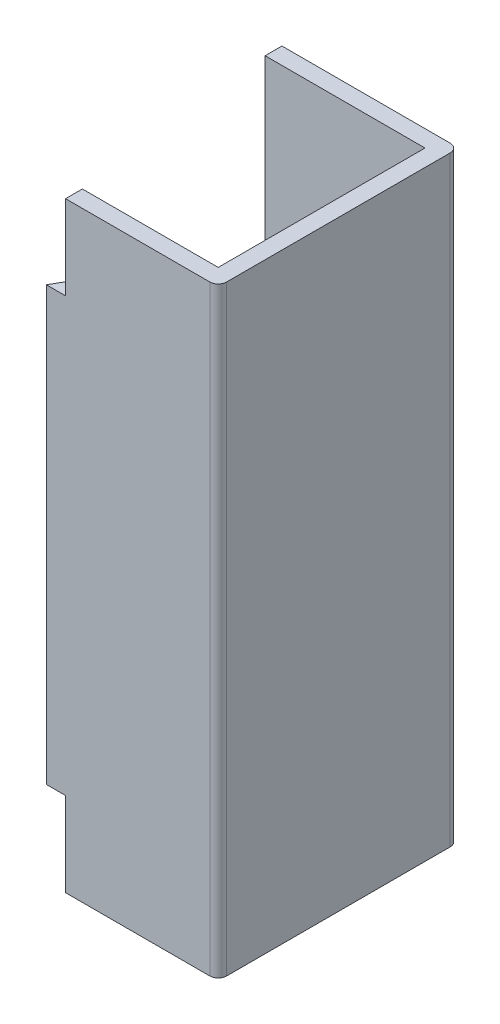
ISO-10303-21;
HEADER;
FILE_DESCRIPTION(('STEP AP214'),'2;1');
FILE_NAME('part.step','',(''),(''),'','','');
FILE_SCHEMA(('AUTOMOTIVE_DESIGN { 1 0 10303 214 1 1 1 1 }'));
ENDSEC;
DATA;
#1=APPLICATION_CONTEXT('core data for automotive mechanical design processes');
#2=APPLICATION_PROTOCOL_DEFINITION('international standard','automotive_design',2000,#1);
#3=PRODUCT_CONTEXT('',#1,'mechanical');
#4=PRODUCT('Part','Part','',(#3));
#5=PRODUCT_RELATED_PRODUCT_CATEGORY('part','',(#4));
#6=PRODUCT_DEFINITION_FORMATION('','',#4);
#7=PRODUCT_DEFINITION_CONTEXT('part definition',#1,'design');
#8=PRODUCT_DEFINITION('design','',#6,#7);
#9=PRODUCT_DEFINITION_SHAPE('','',#8);
#10=(LENGTH_UNIT() NAMED_UNIT(*) SI_UNIT(.MILLI.,.METRE.));
#11=(NAMED_UNIT(*) PLANE_ANGLE_UNIT() SI_UNIT($,.RADIAN.));
#12=(NAMED_UNIT(*) SI_UNIT($,.STERADIAN.) SOLID_ANGLE_UNIT());
#13=UNCERTAINTY_MEASURE_WITH_UNIT(LENGTH_MEASURE(1.E-05),#10,'distance_accuracy_value','');
#14=(GEOMETRIC_REPRESENTATION_CONTEXT(3) GLOBAL_UNCERTAINTY_ASSIGNED_CONTEXT((#13)) GLOBAL_UNIT_ASSIGNED_CONTEXT((#10,
#11,#12)) REPRESENTATION_CONTEXT('',''));
#15=CARTESIAN_POINT('',(0.,0.,0.));
#16=DIRECTION('',(0.,0.,1.));
#17=DIRECTION('',(1.,0.,0.));
#18=AXIS2_PLACEMENT_3D('',#15,#16,#17);
#19=CARTESIAN_POINT('',(0.6825,0.45,0.465));
#20=DIRECTION('',(0.,1.,0.));
#21=DIRECTION('',(0.,0.,1.));
#22=AXIS2_PLACEMENT_3D('',#19,#20,#21);
#23=PLANE('',#22);
#24=DIRECTION('',(0.50000000000019,0.,-0.866025403784329));
#25=VECTOR('',#24,1.);
#26=CARTESIAN_POINT('',(0.662707259422,0.45,0.465));
#27=LINE('',#26,#25);
#28=CARTESIAN_POINT('',(0.662707259422,0.45,0.465));
#29=VERTEX_POINT('',#28);
#30=CARTESIAN_POINT('',(0.642500000000088,0.45,0.500000000000051));
#31=VERTEX_POINT('',#30);
#32=EDGE_CURVE('E124',#29,#31,#27,.F.);
#33=ORIENTED_EDGE('',*,*,#32,.T.);
#34=DIRECTION('',(1.,0.,0.));
#35=VECTOR('',#34,1.);
#36=CARTESIAN_POINT('',(0.816902515723,0.45,0.5));
#37=LINE('',#36,#35);
#38=CARTESIAN_POINT('',(0.6825,0.45,0.5));
#39=VERTEX_POINT('',#38);
#40=EDGE_CURVE('E232',#39,#31,#37,.F.);
#41=ORIENTED_EDGE('',*,*,#40,.F.);
#42=DIRECTION('',(0.,0.,1.));
#43=VECTOR('',#42,1.);
#44=CARTESIAN_POINT('',(0.6825,0.45,0.4825));
#45=LINE('',#44,#43);
#46=CARTESIAN_POINT('',(0.6825,0.45,0.465));
#47=VERTEX_POINT('',#46);
#48=EDGE_CURVE('E144',#39,#47,#45,.F.);
#49=ORIENTED_EDGE('',*,*,#48,.T.);
#50=DIRECTION('',(-1.,0.,0.));
#51=VECTOR('',#50,1.);
#52=CARTESIAN_POINT('',(0.808201510334,0.45,0.465));
#53=LINE('',#52,#51);
#54=EDGE_CURVE('E138',#29,#47,#53,.F.);
#55=ORIENTED_EDGE('',*,*,#54,.F.);
#56=EDGE_LOOP('',(#33,#41,#49,#55));
#57=FACE_BOUND('',#56,.T.);
#58=ADVANCED_FACE('F17',(#57),#23,.T.);
#59=CARTESIAN_POINT('',(0.662707259422,-0.45,0.465));
#60=DIRECTION('',(0.866025403784329,0.,0.50000000000019));
#61=DIRECTION('',(0.50000000000019,0.,-0.866025403784329));
#62=AXIS2_PLACEMENT_3D('',#59,#60,#61);
#63=PLANE('',#62);
#64=DIRECTION('',(0.,1.,0.));
#65=VECTOR('',#64,1.);
#66=CARTESIAN_POINT('',(0.6425,0.,0.5));
#67=LINE('',#66,#65);
#68=CARTESIAN_POINT('',(0.6425,-0.45,0.5));
#69=VERTEX_POINT('',#68);
#70=EDGE_CURVE('E129',#31,#69,#67,.F.);
#71=ORIENTED_EDGE('',*,*,#70,.F.);
#72=ORIENTED_EDGE('',*,*,#32,.F.);
#73=DIRECTION('',(0.,1.,0.));
#74=VECTOR('',#73,1.);
#75=CARTESIAN_POINT('',(0.662707259422,0.,0.465));
#76=LINE('',#75,#74);
#77=CARTESIAN_POINT('',(0.662707259422,-0.45,0.465));
#78=VERTEX_POINT('',#77);
#79=EDGE_CURVE('E128',#78,#29,#76,.T.);
#80=ORIENTED_EDGE('',*,*,#79,.F.);
#81=DIRECTION('',(0.500000000006741,0.,-0.866025403780547));
#82=VECTOR('',#81,1.);
#83=CARTESIAN_POINT('',(0.6425,-0.45,0.5));
#84=LINE('',#83,#82);
#85=EDGE_CURVE('E133',#69,#78,#84,.T.);
#86=ORIENTED_EDGE('',*,*,#85,.F.);
#87=EDGE_LOOP('',(#71,#72,#80,#86));
#88=FACE_BOUND('',#87,.T.);
#89=ADVANCED_FACE('F126',(#88),#63,.F.);
#90=CARTESIAN_POINT('',(0.6825,-0.45,0.5));
#91=DIRECTION('',(0.,-1.,0.));
#92=DIRECTION('',(0.,0.,-1.));
#93=AXIS2_PLACEMENT_3D('',#90,#91,#92);
#94=PLANE('',#93);
#95=ORIENTED_EDGE('',*,*,#85,.T.);
#96=DIRECTION('',(-1.,0.,0.));
#97=VECTOR('',#96,1.);
#98=CARTESIAN_POINT('',(0.808201510334,-0.45,0.465));
#99=LINE('',#98,#97);
#100=CARTESIAN_POINT('',(0.6825,-0.45,0.465));
#101=VERTEX_POINT('',#100);
#102=EDGE_CURVE('E142',#101,#78,#99,.T.);
#103=ORIENTED_EDGE('',*,*,#102,.F.);
#104=DIRECTION('',(0.,0.,1.));
#105=VECTOR('',#104,1.);
#106=CARTESIAN_POINT('',(0.6825,-0.45,0.4825));
#107=LINE('',#106,#105);
#108=CARTESIAN_POINT('',(0.6825,-0.45,0.5));
#109=VERTEX_POINT('',#108);
#110=EDGE_CURVE('E163',#101,#109,#107,.T.);
#111=ORIENTED_EDGE('',*,*,#110,.T.);
#112=DIRECTION('',(1.,0.,0.));
#113=VECTOR('',#112,1.);
#114=CARTESIAN_POINT('',(0.816902515723,-0.45,0.5));
#115=LINE('',#114,#113);
#116=EDGE_CURVE('E209',#69,#109,#115,.T.);
#117=ORIENTED_EDGE('',*,*,#116,.F.);
#118=EDGE_LOOP('',(#95,#103,#111,#117));
#119=FACE_BOUND('',#118,.T.);
#120=ADVANCED_FACE('F330',(#119),#94,.T.);
#121=CARTESIAN_POINT('',(0.6825,0.,0.4825));
#122=DIRECTION('',(1.,0.,0.));
#123=DIRECTION('',(0.,1.,0.));
#124=AXIS2_PLACEMENT_3D('',#121,#122,#123);
#125=PLANE('',#124);
#126=DIRECTION('',(0.,0.,1.));
#127=VECTOR('',#126,1.);
#128=CARTESIAN_POINT('',(0.6825,0.625,0.239822058945));
#129=LINE('',#128,#127);
#130=CARTESIAN_POINT('',(0.6825,0.625,0.465));
#131=VERTEX_POINT('',#130);
#132=CARTESIAN_POINT('',(0.6825,0.625,0.5));
#133=VERTEX_POINT('',#132);
#134=EDGE_CURVE('E201',#131,#133,#129,.T.);
#135=ORIENTED_EDGE('',*,*,#134,.F.);
#136=DIRECTION('',(0.,1.,0.));
#137=VECTOR('',#136,1.);
#138=CARTESIAN_POINT('',(0.6825,0.,0.465));
#139=LINE('',#138,#137);
#140=EDGE_CURVE('E146',#47,#131,#139,.T.);
#141=ORIENTED_EDGE('',*,*,#140,.F.);
#142=ORIENTED_EDGE('',*,*,#48,.F.);
#143=DIRECTION('',(0.,1.,0.));
#144=VECTOR('',#143,1.);
#145=CARTESIAN_POINT('',(0.6825,0.,0.5));
#146=LINE('',#145,#144);
#147=EDGE_CURVE('E223',#133,#39,#146,.F.);
#148=ORIENTED_EDGE('',*,*,#147,.F.);
#149=EDGE_LOOP('',(#135,#141,#142,#148));
#150=FACE_BOUND('',#149,.T.);
#151=ADVANCED_FACE('F332',(#150),#125,.F.);
#152=CARTESIAN_POINT('',(0.6325,0.625,0.));
#153=DIRECTION('',(0.,0.,1.));
#154=DIRECTION('',(1.,0.,0.));
#155=AXIS2_PLACEMENT_3D('',#152,#153,#154);
#156=PLANE('',#155);
#157=DIRECTION('',(1.,0.,0.));
#158=VECTOR('',#157,1.);
#159=CARTESIAN_POINT('',(0.880177932085,-0.625,0.));
#160=LINE('',#159,#158);
#161=CARTESIAN_POINT('',(0.6325,-0.625,0.));
#162=VERTEX_POINT('',#161);
#163=CARTESIAN_POINT('',(0.9825,-0.625,0.));
#164=VERTEX_POINT('',#163);
#165=EDGE_CURVE('E174',#162,#164,#160,.T.);
#166=ORIENTED_EDGE('',*,*,#165,.F.);
#167=DIRECTION('',(0.,1.,0.));
#168=VECTOR('',#167,1.);
#169=CARTESIAN_POINT('',(0.6325,0.,0.));
#170=LINE('',#169,#168);
#171=CARTESIAN_POINT('',(0.6325,0.625,0.));
#172=VERTEX_POINT('',#171);
#173=EDGE_CURVE('E221',#172,#162,#170,.F.);
#174=ORIENTED_EDGE('',*,*,#173,.F.);
#175=DIRECTION('',(-1.,0.,0.));
#176=VECTOR('',#175,1.);
#177=CARTESIAN_POINT('',(0.880177932085,0.625,0.));
#178=LINE('',#177,#176);
#179=CARTESIAN_POINT('',(0.9825,0.625,0.));
#180=VERTEX_POINT('',#179);
#181=EDGE_CURVE('E70',#180,#172,#178,.T.);
#182=ORIENTED_EDGE('',*,*,#181,.F.);
#183=DIRECTION('',(0.,-1.,0.));
#184=VECTOR('',#183,1.);
#185=CARTESIAN_POINT('',(0.9825,0.625,0.));
#186=LINE('',#185,#184);
#187=EDGE_CURVE('E60',#164,#180,#186,.F.);
#188=ORIENTED_EDGE('',*,*,#187,.F.);
#189=EDGE_LOOP('',(#166,#174,#182,#188));
#190=FACE_BOUND('',#189,.T.);
#191=ADVANCED_FACE('F310',(#190),#156,.F.);
#192=CARTESIAN_POINT('',(0.6825,0.,0.4825));
#193=DIRECTION('',(1.,0.,0.));
#194=DIRECTION('',(0.,1.,0.));
#195=AXIS2_PLACEMENT_3D('',#192,#193,#194);
#196=PLANE('',#195);
#197=ORIENTED_EDGE('',*,*,#110,.F.);
#198=DIRECTION('',(0.,1.,0.));
#199=VECTOR('',#198,1.);
#200=CARTESIAN_POINT('',(0.6825,0.,0.465));
#201=LINE('',#200,#199);
#202=CARTESIAN_POINT('',(0.6825,-0.625,0.465));
#203=VERTEX_POINT('',#202);
#204=EDGE_CURVE('E159',#203,#101,#201,.T.);
#205=ORIENTED_EDGE('',*,*,#204,.F.);
#206=DIRECTION('',(0.,0.,1.));
#207=VECTOR('',#206,1.);
#208=CARTESIAN_POINT('',(0.6825,-0.625,0.239822058945));
#209=LINE('',#208,#207);
#210=CARTESIAN_POINT('',(0.6825,-0.625,0.5));
#211=VERTEX_POINT('',#210);
#212=EDGE_CURVE('E179',#211,#203,#209,.F.);
#213=ORIENTED_EDGE('',*,*,#212,.F.);
#214=DIRECTION('',(0.,1.,0.));
#215=VECTOR('',#214,1.);
#216=CARTESIAN_POINT('',(0.6825,0.,0.5));
#217=LINE('',#216,#215);
#218=EDGE_CURVE('E205',#109,#211,#217,.F.);
#219=ORIENTED_EDGE('',*,*,#218,.F.);
#220=EDGE_LOOP('',(#197,#205,#213,#219));
#221=FACE_BOUND('',#220,.T.);
#222=ADVANCED_FACE('F328',(#221),#196,.F.);
#223=CARTESIAN_POINT('',(0.808201510334,0.,0.465));
#224=DIRECTION('',(0.,0.,-1.));
#225=DIRECTION('',(-1.,0.,0.));
#226=AXIS2_PLACEMENT_3D('',#223,#224,#225);
#227=PLANE('',#226);
#228=ORIENTED_EDGE('',*,*,#140,.T.);
#229=DIRECTION('',(-1.,0.,0.));
#230=VECTOR('',#229,1.);
#231=CARTESIAN_POINT('',(0.880177932085,0.625,0.465));
#232=LINE('',#231,#230);
#233=CARTESIAN_POINT('',(0.965,0.625,0.465));
#234=VERTEX_POINT('',#233);
#235=EDGE_CURVE('E236',#234,#131,#232,.T.);
#236=ORIENTED_EDGE('',*,*,#235,.F.);
#237=DIRECTION('',(0.,1.,0.));
#238=VECTOR('',#237,1.);
#239=CARTESIAN_POINT('',(0.965,-0.625,0.465));
#240=LINE('',#239,#238);
#241=CARTESIAN_POINT('',(0.965,-0.625,0.465));
#242=VERTEX_POINT('',#241);
#243=EDGE_CURVE('E148',#234,#242,#240,.F.);
#244=ORIENTED_EDGE('',*,*,#243,.T.);
#245=DIRECTION('',(1.,0.,0.));
#246=VECTOR('',#245,1.);
#247=CARTESIAN_POINT('',(0.880177932085,-0.625,0.465));
#248=LINE('',#247,#246);
#249=EDGE_CURVE('E213',#203,#242,#248,.T.);
#250=ORIENTED_EDGE('',*,*,#249,.F.);
#251=ORIENTED_EDGE('',*,*,#204,.T.);
#252=ORIENTED_EDGE('',*,*,#102,.T.);
#253=ORIENTED_EDGE('',*,*,#79,.T.);
#254=ORIENTED_EDGE('',*,*,#54,.T.);
#255=EDGE_LOOP('',(#228,#236,#244,#250,#251,#252,#253,#254));
#256=FACE_BOUND('',#255,.T.);
#257=ADVANCED_FACE('F137',(#256),#227,.T.);
#258=CARTESIAN_POINT('',(0.965,-0.625,0.0175));
#259=DIRECTION('',(1.,0.,0.));
#260=DIRECTION('',(0.,1.,0.));
#261=AXIS2_PLACEMENT_3D('',#258,#259,#260);
#262=PLANE('',#261);
#263=DIRECTION('',(0.,0.,1.));
#264=VECTOR('',#263,1.);
#265=CARTESIAN_POINT('',(0.965,0.625,0.239822058945));
#266=LINE('',#265,#264);
#267=CARTESIAN_POINT('',(0.965,0.625,0.035));
#268=VERTEX_POINT('',#267);
#269=EDGE_CURVE('E241',#268,#234,#266,.T.);
#270=ORIENTED_EDGE('',*,*,#269,.F.);
#271=DIRECTION('',(0.,1.,0.));
#272=VECTOR('',#271,1.);
#273=CARTESIAN_POINT('',(0.965,-0.625,0.035));
#274=LINE('',#273,#272);
#275=CARTESIAN_POINT('',(0.965,-0.625,0.035));
#276=VERTEX_POINT('',#275);
#277=EDGE_CURVE('E252',#268,#276,#274,.F.);
#278=ORIENTED_EDGE('',*,*,#277,.T.);
#279=DIRECTION('',(0.,0.,1.));
#280=VECTOR('',#279,1.);
#281=CARTESIAN_POINT('',(0.965,-0.625,0.239822058945));
#282=LINE('',#281,#280);
#283=EDGE_CURVE('E288',#242,#276,#282,.F.);
#284=ORIENTED_EDGE('',*,*,#283,.F.);
#285=ORIENTED_EDGE('',*,*,#243,.F.);
#286=EDGE_LOOP('',(#270,#278,#284,#285));
#287=FACE_BOUND('',#286,.T.);
#288=ADVANCED_FACE('F301',(#287),#262,.F.);
#289=CARTESIAN_POINT('',(0.6325,-0.625,0.035));
#290=DIRECTION('',(0.,0.,-1.));
#291=DIRECTION('',(-1.,0.,0.));
#292=AXIS2_PLACEMENT_3D('',#289,#290,#291);
#293=PLANE('',#292);
#294=DIRECTION('',(-1.,0.,0.));
#295=VECTOR('',#294,1.);
#296=CARTESIAN_POINT('',(0.880177932085,0.625,0.035));
#297=LINE('',#296,#295);
#298=CARTESIAN_POINT('',(0.6325,0.625,0.035));
#299=VERTEX_POINT('',#298);
#300=EDGE_CURVE('E208',#299,#268,#297,.F.);
#301=ORIENTED_EDGE('',*,*,#300,.F.);
#302=DIRECTION('',(0.,1.,0.));
#303=VECTOR('',#302,1.);
#304=CARTESIAN_POINT('',(0.6325,0.,0.035));
#305=LINE('',#304,#303);
#306=CARTESIAN_POINT('',(0.6325,-0.625,0.035));
#307=VERTEX_POINT('',#306);
#308=EDGE_CURVE('E224',#307,#299,#305,.T.);
#309=ORIENTED_EDGE('',*,*,#308,.F.);
#310=DIRECTION('',(1.,0.,0.));
#311=VECTOR('',#310,1.);
#312=CARTESIAN_POINT('',(0.880177932085,-0.625,0.035));
#313=LINE('',#312,#311);
#314=EDGE_CURVE('E218',#276,#307,#313,.F.);
#315=ORIENTED_EDGE('',*,*,#314,.F.);
#316=ORIENTED_EDGE('',*,*,#277,.F.);
#317=EDGE_LOOP('',(#301,#309,#315,#316));
#318=FACE_BOUND('',#317,.T.);
#319=ADVANCED_FACE('F306',(#318),#293,.F.);
#320=CARTESIAN_POINT('',(0.6325,0.,0.0175));
#321=DIRECTION('',(-1.,0.,0.));
#322=DIRECTION('',(0.,0.,1.));
#323=AXIS2_PLACEMENT_3D('',#320,#321,#322);
#324=PLANE('',#323);
#325=ORIENTED_EDGE('',*,*,#173,.T.);
#326=DIRECTION('',(0.,0.,1.));
#327=VECTOR('',#326,1.);
#328=CARTESIAN_POINT('',(0.6325,-0.625,0.239822058945));
#329=LINE('',#328,#327);
#330=EDGE_CURVE('E171',#307,#162,#329,.F.);
#331=ORIENTED_EDGE('',*,*,#330,.F.);
#332=ORIENTED_EDGE('',*,*,#308,.T.);
#333=DIRECTION('',(0.,0.,1.));
#334=VECTOR('',#333,1.);
#335=CARTESIAN_POINT('',(0.6325,0.625,0.239822058945));
#336=LINE('',#335,#334);
#337=EDGE_CURVE('E196',#172,#299,#336,.T.);
#338=ORIENTED_EDGE('',*,*,#337,.F.);
#339=EDGE_LOOP('',(#325,#331,#332,#338));
#340=FACE_BOUND('',#339,.T.);
#341=ADVANCED_FACE('F358',(#340),#324,.T.);
#342=CARTESIAN_POINT('',(0.816902515723,0.,0.5));
#343=DIRECTION('',(0.,0.,1.));
#344=DIRECTION('',(1.,0.,0.));
#345=AXIS2_PLACEMENT_3D('',#342,#343,#344);
#346=PLANE('',#345);
#347=DIRECTION('',(1.,0.,0.));
#348=VECTOR('',#347,1.);
#349=CARTESIAN_POINT('',(0.880177932085,-0.625,0.5));
#350=LINE('',#349,#348);
#351=CARTESIAN_POINT('',(0.9825,-0.625,0.5));
#352=VERTEX_POINT('',#351);
#353=EDGE_CURVE('E173',#352,#211,#350,.F.);
#354=ORIENTED_EDGE('',*,*,#353,.F.);
#355=DIRECTION('',(0.,-1.,0.));
#356=VECTOR('',#355,1.);
#357=CARTESIAN_POINT('',(0.9825,0.625,0.5));
#358=LINE('',#357,#356);
#359=CARTESIAN_POINT('',(0.9825,0.625,0.5));
#360=VERTEX_POINT('',#359);
#361=EDGE_CURVE('E168',#360,#352,#358,.T.);
#362=ORIENTED_EDGE('',*,*,#361,.F.);
#363=DIRECTION('',(-1.,0.,0.));
#364=VECTOR('',#363,1.);
#365=CARTESIAN_POINT('',(0.880177932085,0.625,0.5));
#366=LINE('',#365,#364);
#367=EDGE_CURVE('E197',#133,#360,#366,.F.);
#368=ORIENTED_EDGE('',*,*,#367,.F.);
#369=ORIENTED_EDGE('',*,*,#147,.T.);
#370=ORIENTED_EDGE('',*,*,#40,.T.);
#371=ORIENTED_EDGE('',*,*,#70,.T.);
#372=ORIENTED_EDGE('',*,*,#116,.T.);
#373=ORIENTED_EDGE('',*,*,#218,.T.);
#374=EDGE_LOOP('',(#354,#362,#368,#369,#370,#371,#372,#373));
#375=FACE_BOUND('',#374,.T.);
#376=ADVANCED_FACE('F323',(#375),#346,.T.);
#377=CARTESIAN_POINT('',(0.880177932085,0.625,0.239822058945));
#378=DIRECTION('',(0.,1.,0.));
#379=DIRECTION('',(-1.,0.,0.));
#380=AXIS2_PLACEMENT_3D('',#377,#378,#379);
#381=PLANE('',#380);
#382=ORIENTED_EDGE('',*,*,#181,.T.);
#383=ORIENTED_EDGE('',*,*,#337,.T.);
#384=ORIENTED_EDGE('',*,*,#300,.T.);
#385=ORIENTED_EDGE('',*,*,#269,.T.);
#386=ORIENTED_EDGE('',*,*,#235,.T.);
#387=ORIENTED_EDGE('',*,*,#134,.T.);
#388=ORIENTED_EDGE('',*,*,#367,.T.);
#389=CARTESIAN_POINT('',(0.9825,0.625,0.4825));
#390=DIRECTION('',(0.,1.,0.));
#391=DIRECTION('',(0.,0.,1.));
#392=AXIS2_PLACEMENT_3D('',#389,#390,#391);
#393=CIRCLE('',#392,0.0175000000000002);
#394=CARTESIAN_POINT('',(1.,0.625,0.4825));
#395=VERTEX_POINT('',#394);
#396=EDGE_CURVE('E169',#395,#360,#393,.F.);
#397=ORIENTED_EDGE('',*,*,#396,.F.);
#398=DIRECTION('',(0.,0.,1.));
#399=VECTOR('',#398,1.);
#400=CARTESIAN_POINT('',(1.,0.625,0.0175));
#401=LINE('',#400,#399);
#402=CARTESIAN_POINT('',(1.,0.625,0.0175));
#403=VERTEX_POINT('',#402);
#404=EDGE_CURVE('E167',#395,#403,#401,.F.);
#405=ORIENTED_EDGE('',*,*,#404,.T.);
#406=CARTESIAN_POINT('',(0.9825,0.625,0.0175));
#407=DIRECTION('',(0.,1.,0.));
#408=DIRECTION('',(-1.,0.,0.));
#409=AXIS2_PLACEMENT_3D('',#406,#407,#408);
#410=CIRCLE('',#409,0.0174999999999997);
#411=EDGE_CURVE('E20',#180,#403,#410,.F.);
#412=ORIENTED_EDGE('',*,*,#411,.F.);
#413=EDGE_LOOP('',(#382,#383,#384,#385,#386,#387,#388,#397,#405,#412));
#414=FACE_BOUND('',#413,.T.);
#415=ADVANCED_FACE('F317',(#414),#381,.T.);
#416=CARTESIAN_POINT('',(0.9825,0.625,0.0175));
#417=DIRECTION('',(0.,1.,0.));
#418=DIRECTION('',(-1.,0.,0.));
#419=AXIS2_PLACEMENT_3D('',#416,#417,#418);
#420=CYLINDRICAL_SURFACE('',#419,0.0174999999999997);
#421=DIRECTION('',(0.,-1.,0.));
#422=VECTOR('',#421,1.);
#423=CARTESIAN_POINT('',(1.,0.625,0.0175));
#424=LINE('',#423,#422);
#425=CARTESIAN_POINT('',(1.,-0.625,0.0175));
#426=VERTEX_POINT('',#425);
#427=EDGE_CURVE('E189',#403,#426,#424,.T.);
#428=ORIENTED_EDGE('',*,*,#427,.T.);
#429=CARTESIAN_POINT('',(0.9825,-0.625,0.0175));
#430=DIRECTION('',(0.,1.,0.));
#431=DIRECTION('',(-1.,0.,0.));
#432=AXIS2_PLACEMENT_3D('',#429,#430,#431);
#433=CIRCLE('',#432,0.0174999999999997);
#434=EDGE_CURVE('E172',#164,#426,#433,.F.);
#435=ORIENTED_EDGE('',*,*,#434,.F.);
#436=ORIENTED_EDGE('',*,*,#187,.T.);
#437=ORIENTED_EDGE('',*,*,#411,.T.);
#438=EDGE_LOOP('',(#428,#435,#436,#437));
#439=FACE_BOUND('',#438,.T.);
#440=ADVANCED_FACE('F312',(#439),#420,.T.);
#441=CARTESIAN_POINT('',(0.880177932085,-0.625,0.239822058945));
#442=DIRECTION('',(0.,-1.,0.));
#443=DIRECTION('',(1.,0.,0.));
#444=AXIS2_PLACEMENT_3D('',#441,#442,#443);
#445=PLANE('',#444);
#446=ORIENTED_EDGE('',*,*,#314,.T.);
#447=ORIENTED_EDGE('',*,*,#330,.T.);
#448=ORIENTED_EDGE('',*,*,#165,.T.);
#449=ORIENTED_EDGE('',*,*,#434,.T.);
#450=DIRECTION('',(0.,0.,1.));
#451=VECTOR('',#450,1.);
#452=CARTESIAN_POINT('',(1.,-0.625,0.0175));
#453=LINE('',#452,#451);
#454=CARTESIAN_POINT('',(1.,-0.625,0.4825));
#455=VERTEX_POINT('',#454);
#456=EDGE_CURVE('E26',#426,#455,#453,.T.);
#457=ORIENTED_EDGE('',*,*,#456,.T.);
#458=CARTESIAN_POINT('',(0.9825,-0.625,0.4825));
#459=DIRECTION('',(0.,1.,0.));
#460=DIRECTION('',(0.,0.,1.));
#461=AXIS2_PLACEMENT_3D('',#458,#459,#460);
#462=CIRCLE('',#461,0.0175000000000002);
#463=EDGE_CURVE('E34',#352,#455,#462,.T.);
#464=ORIENTED_EDGE('',*,*,#463,.F.);
#465=ORIENTED_EDGE('',*,*,#353,.T.);
#466=ORIENTED_EDGE('',*,*,#212,.T.);
#467=ORIENTED_EDGE('',*,*,#249,.T.);
#468=ORIENTED_EDGE('',*,*,#283,.T.);
#469=EDGE_LOOP('',(#446,#447,#448,#449,#457,#464,#465,#466,#467,#468));
#470=FACE_BOUND('',#469,.T.);
#471=ADVANCED_FACE('F294',(#470),#445,.T.);
#472=CARTESIAN_POINT('',(0.9825,0.625,0.4825));
#473=DIRECTION('',(0.,1.,0.));
#474=DIRECTION('',(0.,0.,1.));
#475=AXIS2_PLACEMENT_3D('',#472,#473,#474);
#476=CYLINDRICAL_SURFACE('',#475,0.0175000000000002);
#477=ORIENTED_EDGE('',*,*,#361,.T.);
#478=ORIENTED_EDGE('',*,*,#463,.T.);
#479=DIRECTION('',(0.,-1.,0.));
#480=VECTOR('',#479,1.);
#481=CARTESIAN_POINT('',(1.,0.625,0.4825));
#482=LINE('',#481,#480);
#483=EDGE_CURVE('E11',#455,#395,#482,.F.);
#484=ORIENTED_EDGE('',*,*,#483,.T.);
#485=ORIENTED_EDGE('',*,*,#396,.T.);
#486=EDGE_LOOP('',(#477,#478,#484,#485));
#487=FACE_BOUND('',#486,.T.);
#488=ADVANCED_FACE('F320',(#487),#476,.T.);
#489=CARTESIAN_POINT('',(1.,0.625,0.0175));
#490=DIRECTION('',(-1.,0.,0.));
#491=DIRECTION('',(0.,-1.,0.));
#492=AXIS2_PLACEMENT_3D('',#489,#490,#491);
#493=PLANE('',#492);
#494=ORIENTED_EDGE('',*,*,#456,.F.);
#495=ORIENTED_EDGE('',*,*,#427,.F.);
#496=ORIENTED_EDGE('',*,*,#404,.F.);
#497=ORIENTED_EDGE('',*,*,#483,.F.);
#498=EDGE_LOOP('',(#494,#495,#496,#497));
#499=FACE_BOUND('',#498,.T.);
#500=ADVANCED_FACE('F315',(#499),#493,.F.);
#501=CLOSED_SHELL('',(#58,#89,#120,#151,#191,#222,#257,#288,#319,#341,#376,#415,#440,#471,#488,#500));
#502=MANIFOLD_SOLID_BREP('B1',#501);
#503=ADVANCED_BREP_SHAPE_REPRESENTATION('',(#18,#502),#14);
#504=SHAPE_DEFINITION_REPRESENTATION(#9,#503);
ENDSEC;
END-ISO-10303-21;
